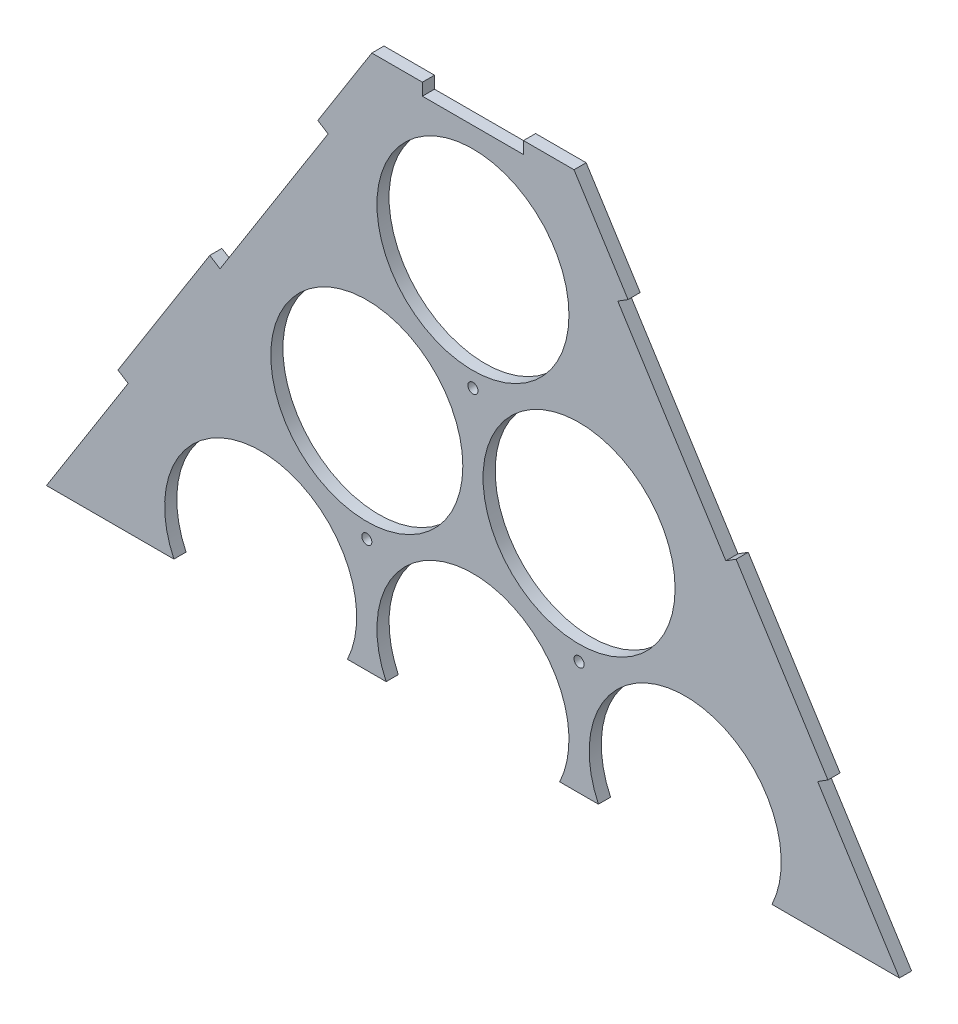
ISO-10303-21;
HEADER;
FILE_DESCRIPTION(('STEP AP214'),'2;1');
FILE_NAME('part.step','',(''),(''),'','','');
FILE_SCHEMA(('AUTOMOTIVE_DESIGN { 1 0 10303 214 1 1 1 1 }'));
ENDSEC;
DATA;
#1=APPLICATION_CONTEXT('core data for automotive mechanical design processes');
#2=APPLICATION_PROTOCOL_DEFINITION('international standard','automotive_design',2000,#1);
#3=PRODUCT_CONTEXT('',#1,'mechanical');
#4=PRODUCT('Part','Part','',(#3));
#5=PRODUCT_RELATED_PRODUCT_CATEGORY('part','',(#4));
#6=PRODUCT_DEFINITION_FORMATION('','',#4);
#7=PRODUCT_DEFINITION_CONTEXT('part definition',#1,'design');
#8=PRODUCT_DEFINITION('design','',#6,#7);
#9=PRODUCT_DEFINITION_SHAPE('','',#8);
#10=(LENGTH_UNIT() NAMED_UNIT(*) SI_UNIT(.MILLI.,.METRE.));
#11=(NAMED_UNIT(*) PLANE_ANGLE_UNIT() SI_UNIT($,.RADIAN.));
#12=(NAMED_UNIT(*) SI_UNIT($,.STERADIAN.) SOLID_ANGLE_UNIT());
#13=UNCERTAINTY_MEASURE_WITH_UNIT(LENGTH_MEASURE(1.E-05),#10,'distance_accuracy_value','');
#14=(GEOMETRIC_REPRESENTATION_CONTEXT(3) GLOBAL_UNCERTAINTY_ASSIGNED_CONTEXT((#13)) GLOBAL_UNIT_ASSIGNED_CONTEXT((#10,
#11,#12)) REPRESENTATION_CONTEXT('',''));
#15=CARTESIAN_POINT('',(0.,0.,0.));
#16=DIRECTION('',(0.,0.,1.));
#17=DIRECTION('',(1.,0.,0.));
#18=AXIS2_PLACEMENT_3D('',#15,#16,#17);
#19=CARTESIAN_POINT('',(-50.0000000000002,336.353741833179,6.));
#20=DIRECTION('',(0.845179377846631,-0.53448275862069,0.));
#21=DIRECTION('',(0.53448275862069,0.845179377846631,0.));
#22=AXIS2_PLACEMENT_3D('',#19,#20,#21);
#23=PLANE('',#22);
#24=DIRECTION('',(-0.53448275862069,-0.845179377846631,0.));
#25=VECTOR('',#24,1.);
#26=CARTESIAN_POINT('',(-50.0000000000002,336.353741833179,0.));
#27=LINE('',#26,#25);
#28=CARTESIAN_POINT('',(-50.0000000000002,336.353741833179,0.));
#29=VERTEX_POINT('',#28);
#30=CARTESIAN_POINT('',(-76.7241379310347,294.094772940848,0.));
#31=VERTEX_POINT('',#30);
#32=EDGE_CURVE('E320',#29,#31,#27,.T.);
#33=ORIENTED_EDGE('',*,*,#32,.T.);
#34=DIRECTION('',(0.,0.,1.));
#35=VECTOR('',#34,1.);
#36=CARTESIAN_POINT('',(-76.7241379310347,294.094772940848,6.));
#37=LINE('',#36,#35);
#38=CARTESIAN_POINT('',(-76.7241379310347,294.094772940848,6.));
#39=VERTEX_POINT('',#38);
#40=EDGE_CURVE('E356',#31,#39,#37,.T.);
#41=ORIENTED_EDGE('',*,*,#40,.T.);
#42=DIRECTION('',(-0.53448275862069,-0.845179377846631,0.));
#43=VECTOR('',#42,1.);
#44=CARTESIAN_POINT('',(-50.0000000000002,336.353741833179,6.));
#45=LINE('',#44,#43);
#46=CARTESIAN_POINT('',(-50.0000000000002,336.353741833179,6.));
#47=VERTEX_POINT('',#46);
#48=EDGE_CURVE('E308',#47,#39,#45,.T.);
#49=ORIENTED_EDGE('',*,*,#48,.F.);
#50=DIRECTION('',(0.,0.,-1.));
#51=VECTOR('',#50,1.);
#52=CARTESIAN_POINT('',(-50.0000000000002,336.353741833179,6.));
#53=LINE('',#52,#51);
#54=EDGE_CURVE('E318',#47,#29,#53,.T.);
#55=ORIENTED_EDGE('',*,*,#54,.T.);
#56=EDGE_LOOP('',(#33,#41,#49,#55));
#57=FACE_BOUND('',#56,.T.);
#58=ADVANCED_FACE('F34',(#57),#23,.F.);
#59=CARTESIAN_POINT('',(-130.172413793106,209.576835156186,6.));
#60=VERTEX_POINT('',#59);
#61=CARTESIAN_POINT('',(-175.603448275862,137.736588039221,6.));
#62=VERTEX_POINT('',#61);
#63=EDGE_CURVE('E312',#60,#62,#45,.T.);
#64=ORIENTED_EDGE('',*,*,#63,.F.);
#65=DIRECTION('',(0.,0.,-1.));
#66=VECTOR('',#65,1.);
#67=CARTESIAN_POINT('',(-130.172413793104,209.576835156185,6.));
#68=LINE('',#67,#66);
#69=CARTESIAN_POINT('',(-130.172413793104,209.576835156185,0.));
#70=VERTEX_POINT('',#69);
#71=EDGE_CURVE('E353',#60,#70,#68,.T.);
#72=ORIENTED_EDGE('',*,*,#71,.T.);
#73=CARTESIAN_POINT('',(-175.603448275862,137.736588039221,0.));
#74=VERTEX_POINT('',#73);
#75=EDGE_CURVE('E305',#70,#74,#27,.T.);
#76=ORIENTED_EDGE('',*,*,#75,.T.);
#77=DIRECTION('',(0.,0.,1.));
#78=VECTOR('',#77,1.);
#79=CARTESIAN_POINT('',(-175.603448275862,137.736588039221,6.));
#80=LINE('',#79,#78);
#81=EDGE_CURVE('E350',#74,#62,#80,.T.);
#82=ORIENTED_EDGE('',*,*,#81,.T.);
#83=EDGE_LOOP('',(#64,#72,#76,#82));
#84=FACE_BOUND('',#83,.T.);
#85=ADVANCED_FACE('F473',(#84),#23,.F.);
#86=CARTESIAN_POINT('',(255.775862068966,10.9596813622265,6.));
#87=DIRECTION('',(-0.84517937784663,-0.53448275862069,0.));
#88=DIRECTION('',(0.53448275862069,-0.84517937784663,0.));
#89=AXIS2_PLACEMENT_3D('',#86,#87,#88);
#90=PLANE('',#89);
#91=DIRECTION('',(-0.53448275862069,0.84517937784663,0.));
#92=VECTOR('',#91,1.);
#93=CARTESIAN_POINT('',(255.775862068966,10.9596813622265,6.));
#94=LINE('',#93,#92);
#95=CARTESIAN_POINT('',(175.603448275862,137.736588039221,6.));
#96=VERTEX_POINT('',#95);
#97=CARTESIAN_POINT('',(130.172413793102,209.576835156186,6.));
#98=VERTEX_POINT('',#97);
#99=EDGE_CURVE('E314',#96,#98,#94,.T.);
#100=ORIENTED_EDGE('',*,*,#99,.F.);
#101=DIRECTION('',(0.,0.,-1.));
#102=VECTOR('',#101,1.);
#103=CARTESIAN_POINT('',(175.603448275862,137.736588039221,6.));
#104=LINE('',#103,#102);
#105=CARTESIAN_POINT('',(175.603448275862,137.736588039221,0.));
#106=VERTEX_POINT('',#105);
#107=EDGE_CURVE('E347',#96,#106,#104,.T.);
#108=ORIENTED_EDGE('',*,*,#107,.T.);
#109=DIRECTION('',(-0.53448275862069,0.84517937784663,0.));
#110=VECTOR('',#109,1.);
#111=CARTESIAN_POINT('',(255.775862068966,10.9596813622265,0.));
#112=LINE('',#111,#110);
#113=CARTESIAN_POINT('',(130.172413793102,209.576835156184,0.));
#114=VERTEX_POINT('',#113);
#115=EDGE_CURVE('E325',#106,#114,#112,.T.);
#116=ORIENTED_EDGE('',*,*,#115,.T.);
#117=DIRECTION('',(0.,0.,1.));
#118=VECTOR('',#117,1.);
#119=CARTESIAN_POINT('',(130.172413793103,209.576835156185,6.));
#120=LINE('',#119,#118);
#121=EDGE_CURVE('E341',#114,#98,#120,.T.);
#122=ORIENTED_EDGE('',*,*,#121,.T.);
#123=EDGE_LOOP('',(#100,#108,#116,#122));
#124=FACE_BOUND('',#123,.T.);
#125=ADVANCED_FACE('F503',(#124),#90,.F.);
#126=CARTESIAN_POINT('',(76.7241379310346,294.094772940848,6.));
#127=VERTEX_POINT('',#126);
#128=CARTESIAN_POINT('',(49.9999999999998,336.353741833179,6.));
#129=VERTEX_POINT('',#128);
#130=EDGE_CURVE('E311',#127,#129,#94,.T.);
#131=ORIENTED_EDGE('',*,*,#130,.F.);
#132=DIRECTION('',(0.,0.,-1.));
#133=VECTOR('',#132,1.);
#134=CARTESIAN_POINT('',(76.7241379310345,294.094772940847,6.));
#135=LINE('',#134,#133);
#136=CARTESIAN_POINT('',(76.7241379310346,294.094772940848,0.));
#137=VERTEX_POINT('',#136);
#138=EDGE_CURVE('E344',#127,#137,#135,.T.);
#139=ORIENTED_EDGE('',*,*,#138,.T.);
#140=CARTESIAN_POINT('',(49.9999999999998,336.353741833179,0.));
#141=VERTEX_POINT('',#140);
#142=EDGE_CURVE('E323',#137,#141,#112,.T.);
#143=ORIENTED_EDGE('',*,*,#142,.T.);
#144=DIRECTION('',(0.,0.,-1.));
#145=VECTOR('',#144,1.);
#146=CARTESIAN_POINT('',(49.9999999999998,336.353741833179,6.));
#147=LINE('',#146,#145);
#148=EDGE_CURVE('E332',#129,#141,#147,.T.);
#149=ORIENTED_EDGE('',*,*,#148,.F.);
#150=EDGE_LOOP('',(#131,#139,#143,#149));
#151=FACE_BOUND('',#150,.T.);
#152=ADVANCED_FACE('F511',(#151),#90,.F.);
#153=CARTESIAN_POINT('',(-50.0000000000002,336.353741833179,6.));
#154=DIRECTION('',(0.,-1.,0.));
#155=DIRECTION('',(1.,0.,0.));
#156=AXIS2_PLACEMENT_3D('',#153,#154,#155);
#157=PLANE('',#156);
#158=DIRECTION('',(-1.,0.,0.));
#159=VECTOR('',#158,1.);
#160=CARTESIAN_POINT('',(-50.0000000000002,336.353741833179,6.));
#161=LINE('',#160,#159);
#162=CARTESIAN_POINT('',(-25.,336.353741833179,6.));
#163=VERTEX_POINT('',#162);
#164=EDGE_CURVE('E319',#163,#47,#161,.T.);
#165=ORIENTED_EDGE('',*,*,#164,.F.);
#166=DIRECTION('',(0.,0.,-1.));
#167=VECTOR('',#166,1.);
#168=CARTESIAN_POINT('',(-25.,336.353741833179,6.));
#169=LINE('',#168,#167);
#170=CARTESIAN_POINT('',(-25.,336.353741833179,0.));
#171=VERTEX_POINT('',#170);
#172=EDGE_CURVE('E338',#163,#171,#169,.T.);
#173=ORIENTED_EDGE('',*,*,#172,.T.);
#174=DIRECTION('',(-1.,0.,0.));
#175=VECTOR('',#174,1.);
#176=CARTESIAN_POINT('',(-50.0000000000002,336.353741833179,0.));
#177=LINE('',#176,#175);
#178=EDGE_CURVE('E329',#171,#29,#177,.T.);
#179=ORIENTED_EDGE('',*,*,#178,.T.);
#180=ORIENTED_EDGE('',*,*,#54,.F.);
#181=EDGE_LOOP('',(#165,#173,#179,#180));
#182=FACE_BOUND('',#181,.T.);
#183=ADVANCED_FACE('F447',(#182),#157,.F.);
#184=CARTESIAN_POINT('',(0.,0.,6.));
#185=DIRECTION('',(0.,0.,-1.));
#186=DIRECTION('',(-1.,0.,0.));
#187=AXIS2_PLACEMENT_3D('',#184,#185,#186);
#188=PLANE('',#187);
#189=CARTESIAN_POINT('',(-52.5,126.865334794732,6.));
#190=DIRECTION('',(0.,0.,1.));
#191=DIRECTION('',(1.,0.,0.));
#192=AXIS2_PLACEMENT_3D('',#189,#190,#191);
#193=CIRCLE('',#192,2.5);
#194=CARTESIAN_POINT('',(-50.,126.865334794732,6.));
#195=VERTEX_POINT('',#194);
#196=EDGE_CURVE('E372',#195,#195,#193,.T.);
#197=ORIENTED_EDGE('',*,*,#196,.F.);
#198=EDGE_LOOP('',(#197));
#199=FACE_BOUND('',#198,.T.);
#200=CARTESIAN_POINT('',(0.,217.798002192098,6.));
#201=DIRECTION('',(0.,0.,1.));
#202=DIRECTION('',(1.,0.,0.));
#203=AXIS2_PLACEMENT_3D('',#200,#201,#202);
#204=CIRCLE('',#203,2.5);
#205=CARTESIAN_POINT('',(2.5,217.798002192098,6.));
#206=VERTEX_POINT('',#205);
#207=EDGE_CURVE('E812',#206,#206,#204,.T.);
#208=ORIENTED_EDGE('',*,*,#207,.F.);
#209=EDGE_LOOP('',(#208));
#210=FACE_BOUND('',#209,.T.);
#211=CARTESIAN_POINT('',(52.5,126.865334794732,6.));
#212=DIRECTION('',(0.,0.,1.));
#213=DIRECTION('',(1.,0.,0.));
#214=AXIS2_PLACEMENT_3D('',#211,#212,#213);
#215=CIRCLE('',#214,2.5);
#216=CARTESIAN_POINT('',(55.,126.865334794732,6.));
#217=VERTEX_POINT('',#216);
#218=EDGE_CURVE('E384',#217,#217,#215,.T.);
#219=ORIENTED_EDGE('',*,*,#218,.F.);
#220=EDGE_LOOP('',(#219));
#221=FACE_BOUND('',#220,.T.);
#222=DIRECTION('',(0.53448275862069,0.84517937784663,0.));
#223=VECTOR('',#222,1.);
#224=CARTESIAN_POINT('',(-223.980647870851,50.0117537028338,6.));
#225=LINE('',#224,#223);
#226=CARTESIAN_POINT('',(-210.972398171467,70.5817425574265,6.));
#227=VERTEX_POINT('',#226);
#228=CARTESIAN_POINT('',(-170.532372008782,134.529691487497,6.));
#229=VERTEX_POINT('',#228);
#230=EDGE_CURVE('E249',#227,#229,#225,.T.);
#231=ORIENTED_EDGE('',*,*,#230,.F.);
#232=DIRECTION('',(-1.,0.,0.));
#233=VECTOR('',#232,1.);
#234=CARTESIAN_POINT('',(314.768700541544,70.5817425574265,6.));
#235=LINE('',#234,#233);
#236=CARTESIAN_POINT('',(-147.919574300768,70.5817425574265,6.));
#237=VERTEX_POINT('',#236);
#238=EDGE_CURVE('E233',#237,#227,#235,.T.);
#239=ORIENTED_EDGE('',*,*,#238,.F.);
#240=CARTESIAN_POINT('',(-105.,90.932667397366,6.));
#241=DIRECTION('',(0.,0.,1.));
#242=DIRECTION('',(1.,0.,0.));
#243=AXIS2_PLACEMENT_3D('',#240,#241,#242);
#244=CIRCLE('',#243,47.5);
#245=CARTESIAN_POINT('',(-62.0804256992321,70.5817425574265,6.));
#246=VERTEX_POINT('',#245);
#247=EDGE_CURVE('E302',#246,#237,#244,.T.);
#248=ORIENTED_EDGE('',*,*,#247,.F.);
#249=CARTESIAN_POINT('',(-42.9195743007679,70.5817425574265,6.));
#250=VERTEX_POINT('',#249);
#251=EDGE_CURVE('E379',#250,#246,#235,.T.);
#252=ORIENTED_EDGE('',*,*,#251,.F.);
#253=CARTESIAN_POINT('',(0.,90.932667397366,6.));
#254=DIRECTION('',(0.,0.,1.));
#255=DIRECTION('',(1.,0.,0.));
#256=AXIS2_PLACEMENT_3D('',#253,#254,#255);
#257=CIRCLE('',#256,47.5);
#258=CARTESIAN_POINT('',(42.9195743007679,70.5817425574265,6.));
#259=VERTEX_POINT('',#258);
#260=EDGE_CURVE('E296',#259,#250,#257,.T.);
#261=ORIENTED_EDGE('',*,*,#260,.F.);
#262=CARTESIAN_POINT('',(62.0804256992321,70.5817425574265,6.));
#263=VERTEX_POINT('',#262);
#264=EDGE_CURVE('E231',#263,#259,#235,.T.);
#265=ORIENTED_EDGE('',*,*,#264,.F.);
#266=CARTESIAN_POINT('',(105.,90.932667397366,6.));
#267=DIRECTION('',(0.,0.,1.));
#268=DIRECTION('',(1.,0.,0.));
#269=AXIS2_PLACEMENT_3D('',#266,#267,#268);
#270=CIRCLE('',#269,47.5);
#271=CARTESIAN_POINT('',(147.919574300768,70.5817425574265,6.));
#272=VERTEX_POINT('',#271);
#273=EDGE_CURVE('E229',#272,#263,#270,.T.);
#274=ORIENTED_EDGE('',*,*,#273,.F.);
#275=CARTESIAN_POINT('',(210.972398171467,70.5817425574265,6.));
#276=VERTEX_POINT('',#275);
#277=EDGE_CURVE('E210',#276,#272,#235,.T.);
#278=ORIENTED_EDGE('',*,*,#277,.F.);
#279=DIRECTION('',(0.53448275862069,-0.84517937784663,0.));
#280=VECTOR('',#279,1.);
#281=CARTESIAN_POINT('',(223.980647870851,50.0117537028338,6.));
#282=LINE('',#281,#280);
#283=CARTESIAN_POINT('',(170.532372008782,134.529691487497,6.));
#284=VERTEX_POINT('',#283);
#285=EDGE_CURVE('E226',#284,#276,#282,.T.);
#286=ORIENTED_EDGE('',*,*,#285,.F.);
#287=DIRECTION('',(-0.845179377846625,-0.534482758620698,0.));
#288=VECTOR('',#287,1.);
#289=CARTESIAN_POINT('',(170.532372008782,134.529691487497,6.));
#290=LINE('',#289,#288);
#291=EDGE_CURVE('E238',#96,#284,#290,.T.);
#292=ORIENTED_EDGE('',*,*,#291,.F.);
#293=ORIENTED_EDGE('',*,*,#99,.T.);
#294=DIRECTION('',(0.845179377846625,0.534482758620699,0.));
#295=VECTOR('',#294,1.);
#296=CARTESIAN_POINT('',(130.172413793102,209.576835156184,6.));
#297=LINE('',#296,#295);
#298=CARTESIAN_POINT('',(125.101337526023,206.36993860446,6.));
#299=VERTEX_POINT('',#298);
#300=EDGE_CURVE('E422',#299,#98,#297,.T.);
#301=ORIENTED_EDGE('',*,*,#300,.F.);
#302=DIRECTION('',(0.53448275862069,-0.84517937784663,0.));
#303=VECTOR('',#302,1.);
#304=CARTESIAN_POINT('',(125.101337526023,206.36993860446,6.));
#305=LINE('',#304,#303);
#306=CARTESIAN_POINT('',(71.6530616639535,290.887876389123,6.));
#307=VERTEX_POINT('',#306);
#308=EDGE_CURVE('E248',#307,#299,#305,.T.);
#309=ORIENTED_EDGE('',*,*,#308,.F.);
#310=DIRECTION('',(-0.845179377846638,-0.534482758620678,0.));
#311=VECTOR('',#310,1.);
#312=CARTESIAN_POINT('',(71.6530616639535,290.887876389123,6.));
#313=LINE('',#312,#311);
#314=EDGE_CURVE('E424',#127,#307,#313,.T.);
#315=ORIENTED_EDGE('',*,*,#314,.F.);
#316=ORIENTED_EDGE('',*,*,#130,.T.);
#317=CARTESIAN_POINT('',(25.,336.353741833179,6.));
#318=VERTEX_POINT('',#317);
#319=EDGE_CURVE('E315',#129,#318,#161,.T.);
#320=ORIENTED_EDGE('',*,*,#319,.T.);
#321=DIRECTION('',(0.,1.,0.));
#322=VECTOR('',#321,1.);
#323=CARTESIAN_POINT('',(25.,336.353741833179,6.));
#324=LINE('',#323,#322);
#325=CARTESIAN_POINT('',(25.,330.353741833179,6.));
#326=VERTEX_POINT('',#325);
#327=EDGE_CURVE('E415',#326,#318,#324,.T.);
#328=ORIENTED_EDGE('',*,*,#327,.F.);
#329=DIRECTION('',(1.,0.,0.));
#330=VECTOR('',#329,1.);
#331=CARTESIAN_POINT('',(-25.,330.353741833179,6.));
#332=LINE('',#331,#330);
#333=CARTESIAN_POINT('',(-25.,330.353741833179,6.));
#334=VERTEX_POINT('',#333);
#335=EDGE_CURVE('E411',#334,#326,#332,.T.);
#336=ORIENTED_EDGE('',*,*,#335,.F.);
#337=DIRECTION('',(0.,-1.,0.));
#338=VECTOR('',#337,1.);
#339=CARTESIAN_POINT('',(-25.,336.353741833179,6.));
#340=LINE('',#339,#338);
#341=EDGE_CURVE('E408',#163,#334,#340,.T.);
#342=ORIENTED_EDGE('',*,*,#341,.F.);
#343=ORIENTED_EDGE('',*,*,#164,.T.);
#344=ORIENTED_EDGE('',*,*,#48,.T.);
#345=DIRECTION('',(-0.845179377846631,0.534482758620689,0.));
#346=VECTOR('',#345,1.);
#347=CARTESIAN_POINT('',(-71.6530616639567,290.887876389125,6.));
#348=LINE('',#347,#346);
#349=CARTESIAN_POINT('',(-71.6530616639567,290.887876389125,6.));
#350=VERTEX_POINT('',#349);
#351=EDGE_CURVE('E403',#350,#39,#348,.T.);
#352=ORIENTED_EDGE('',*,*,#351,.F.);
#353=DIRECTION('',(0.53448275862069,0.84517937784663,0.));
#354=VECTOR('',#353,1.);
#355=CARTESIAN_POINT('',(-125.101337526026,206.369938604462,6.));
#356=LINE('',#355,#354);
#357=CARTESIAN_POINT('',(-125.101337526026,206.369938604462,6.));
#358=VERTEX_POINT('',#357);
#359=EDGE_CURVE('E399',#358,#350,#356,.T.);
#360=ORIENTED_EDGE('',*,*,#359,.F.);
#361=DIRECTION('',(0.845179377846637,-0.53448275862068,0.));
#362=VECTOR('',#361,1.);
#363=CARTESIAN_POINT('',(-130.172413793106,209.576835156186,6.));
#364=LINE('',#363,#362);
#365=EDGE_CURVE('E396',#60,#358,#364,.T.);
#366=ORIENTED_EDGE('',*,*,#365,.F.);
#367=ORIENTED_EDGE('',*,*,#63,.T.);
#368=DIRECTION('',(-0.845179377846629,0.534482758620692,0.));
#369=VECTOR('',#368,1.);
#370=CARTESIAN_POINT('',(-170.532372008782,134.529691487497,6.));
#371=LINE('',#370,#369);
#372=EDGE_CURVE('E251',#229,#62,#371,.T.);
#373=ORIENTED_EDGE('',*,*,#372,.F.);
#374=EDGE_LOOP('',(#231,#239,#248,#252,#261,#265,#274,#278,#286,#292,#293,#301,#309,#315,#316,
#320,#328,#336,#342,#343,#344,#352,#360,#366,#367,#373));
#375=FACE_BOUND('',#374,.T.);
#376=CARTESIAN_POINT('',(-52.5,181.865334794732,6.));
#377=DIRECTION('',(0.,0.,1.));
#378=DIRECTION('',(1.,0.,0.));
#379=AXIS2_PLACEMENT_3D('',#376,#377,#378);
#380=CIRCLE('',#379,47.5);
#381=CARTESIAN_POINT('',(-4.99999999999998,181.865334794732,6.));
#382=VERTEX_POINT('',#381);
#383=EDGE_CURVE('E286',#382,#382,#380,.T.);
#384=ORIENTED_EDGE('',*,*,#383,.F.);
#385=EDGE_LOOP('',(#384));
#386=FACE_BOUND('',#385,.T.);
#387=CARTESIAN_POINT('',(52.5,181.865334794732,6.));
#388=DIRECTION('',(0.,0.,1.));
#389=DIRECTION('',(1.,0.,0.));
#390=AXIS2_PLACEMENT_3D('',#387,#388,#389);
#391=CIRCLE('',#390,47.5);
#392=CARTESIAN_POINT('',(100.,181.865334794732,6.));
#393=VERTEX_POINT('',#392);
#394=EDGE_CURVE('E280',#393,#393,#391,.T.);
#395=ORIENTED_EDGE('',*,*,#394,.F.);
#396=EDGE_LOOP('',(#395));
#397=FACE_BOUND('',#396,.T.);
#398=CARTESIAN_POINT('',(0.,272.798002192098,6.));
#399=DIRECTION('',(0.,0.,1.));
#400=DIRECTION('',(1.,0.,0.));
#401=AXIS2_PLACEMENT_3D('',#398,#399,#400);
#402=CIRCLE('',#401,47.5);
#403=CARTESIAN_POINT('',(47.5,272.798002192098,6.));
#404=VERTEX_POINT('',#403);
#405=EDGE_CURVE('E274',#404,#404,#402,.T.);
#406=ORIENTED_EDGE('',*,*,#405,.F.);
#407=EDGE_LOOP('',(#406));
#408=FACE_BOUND('',#407,.T.);
#409=ADVANCED_FACE('F223',(#199,#210,#221,#375,#386,#397,#408),#188,.F.);
#410=CARTESIAN_POINT('',(0.,0.,0.));
#411=DIRECTION('',(0.,0.,-1.));
#412=DIRECTION('',(-1.,0.,0.));
#413=AXIS2_PLACEMENT_3D('',#410,#411,#412);
#414=PLANE('',#413);
#415=CARTESIAN_POINT('',(-52.5,126.865334794732,0.));
#416=DIRECTION('',(0.,0.,-1.));
#417=DIRECTION('',(-1.,0.,0.));
#418=AXIS2_PLACEMENT_3D('',#415,#416,#417);
#419=CIRCLE('',#418,2.5);
#420=CARTESIAN_POINT('',(-55.,126.865334794732,0.));
#421=VERTEX_POINT('',#420);
#422=EDGE_CURVE('E37',#421,#421,#419,.T.);
#423=ORIENTED_EDGE('',*,*,#422,.F.);
#424=EDGE_LOOP('',(#423));
#425=FACE_BOUND('',#424,.T.);
#426=CARTESIAN_POINT('',(0.,217.798002192098,0.));
#427=DIRECTION('',(0.,0.,-1.));
#428=DIRECTION('',(-1.,0.,0.));
#429=AXIS2_PLACEMENT_3D('',#426,#427,#428);
#430=CIRCLE('',#429,2.5);
#431=CARTESIAN_POINT('',(-2.5,217.798002192098,0.));
#432=VERTEX_POINT('',#431);
#433=EDGE_CURVE('E371',#432,#432,#430,.T.);
#434=ORIENTED_EDGE('',*,*,#433,.F.);
#435=EDGE_LOOP('',(#434));
#436=FACE_BOUND('',#435,.T.);
#437=CARTESIAN_POINT('',(52.5,126.865334794732,0.));
#438=DIRECTION('',(0.,0.,-1.));
#439=DIRECTION('',(-1.,0.,0.));
#440=AXIS2_PLACEMENT_3D('',#437,#438,#439);
#441=CIRCLE('',#440,2.5);
#442=CARTESIAN_POINT('',(50.,126.865334794732,0.));
#443=VERTEX_POINT('',#442);
#444=EDGE_CURVE('E369',#443,#443,#441,.T.);
#445=ORIENTED_EDGE('',*,*,#444,.F.);
#446=EDGE_LOOP('',(#445));
#447=FACE_BOUND('',#446,.T.);
#448=DIRECTION('',(1.,0.,0.));
#449=VECTOR('',#448,1.);
#450=CARTESIAN_POINT('',(0.,70.5817425574265,0.));
#451=LINE('',#450,#449);
#452=CARTESIAN_POINT('',(-210.972398171467,70.5817425574265,0.));
#453=VERTEX_POINT('',#452);
#454=CARTESIAN_POINT('',(-147.919574300768,70.5817425574265,0.));
#455=VERTEX_POINT('',#454);
#456=EDGE_CURVE('E230',#453,#455,#451,.T.);
#457=ORIENTED_EDGE('',*,*,#456,.F.);
#458=DIRECTION('',(-0.53448275862069,-0.845179377846631,0.));
#459=VECTOR('',#458,1.);
#460=CARTESIAN_POINT('',(-182.587688528877,115.466579063644,0.));
#461=LINE('',#460,#459);
#462=CARTESIAN_POINT('',(-170.532372008782,134.529691487497,0.));
#463=VERTEX_POINT('',#462);
#464=EDGE_CURVE('E359',#463,#453,#461,.T.);
#465=ORIENTED_EDGE('',*,*,#464,.F.);
#466=DIRECTION('',(0.84517937784663,-0.534482758620692,0.));
#467=VECTOR('',#466,1.);
#468=CARTESIAN_POINT('',(12.0553165200939,19.0631124238527,0.));
#469=LINE('',#468,#467);
#470=EDGE_CURVE('E267',#74,#463,#469,.T.);
#471=ORIENTED_EDGE('',*,*,#470,.F.);
#472=ORIENTED_EDGE('',*,*,#75,.F.);
#473=DIRECTION('',(-0.845179377846637,0.53448275862068,0.));
#474=VECTOR('',#473,1.);
#475=CARTESIAN_POINT('',(57.486351002853,90.9033595408196,0.));
#476=LINE('',#475,#474);
#477=CARTESIAN_POINT('',(-125.101337526026,206.369938604462,0.));
#478=VERTEX_POINT('',#477);
#479=EDGE_CURVE('E269',#478,#70,#476,.T.);
#480=ORIENTED_EDGE('',*,*,#479,.F.);
#481=DIRECTION('',(-0.53448275862069,-0.845179377846631,0.));
#482=VECTOR('',#481,1.);
#483=CARTESIAN_POINT('',(-182.587688528878,115.466579063645,0.));
#484=LINE('',#483,#482);
#485=CARTESIAN_POINT('',(-71.6530616639567,290.887876389125,0.));
#486=VERTEX_POINT('',#485);
#487=EDGE_CURVE('E362',#486,#478,#484,.T.);
#488=ORIENTED_EDGE('',*,*,#487,.F.);
#489=DIRECTION('',(0.845179377846631,-0.534482758620688,0.));
#490=VECTOR('',#489,1.);
#491=CARTESIAN_POINT('',(110.934626864922,175.42129732548,0.));
#492=LINE('',#491,#490);
#493=EDGE_CURVE('E271',#31,#486,#492,.T.);
#494=ORIENTED_EDGE('',*,*,#493,.F.);
#495=ORIENTED_EDGE('',*,*,#32,.F.);
#496=ORIENTED_EDGE('',*,*,#178,.F.);
#497=DIRECTION('',(0.,1.,0.));
#498=VECTOR('',#497,1.);
#499=CARTESIAN_POINT('',(-25.,0.,0.));
#500=LINE('',#499,#498);
#501=CARTESIAN_POINT('',(-25.,330.353741833179,0.));
#502=VERTEX_POINT('',#501);
#503=EDGE_CURVE('E259',#502,#171,#500,.T.);
#504=ORIENTED_EDGE('',*,*,#503,.F.);
#505=DIRECTION('',(-1.,0.,0.));
#506=VECTOR('',#505,1.);
#507=CARTESIAN_POINT('',(3.6676633045427E-13,330.353741833179,0.));
#508=LINE('',#507,#506);
#509=CARTESIAN_POINT('',(25.,330.353741833179,0.));
#510=VERTEX_POINT('',#509);
#511=EDGE_CURVE('E364',#510,#502,#508,.T.);
#512=ORIENTED_EDGE('',*,*,#511,.F.);
#513=DIRECTION('',(0.,-1.,0.));
#514=VECTOR('',#513,1.);
#515=CARTESIAN_POINT('',(25.0000000000003,0.,0.));
#516=LINE('',#515,#514);
#517=CARTESIAN_POINT('',(25.,336.353741833179,0.));
#518=VERTEX_POINT('',#517);
#519=EDGE_CURVE('E257',#518,#510,#516,.T.);
#520=ORIENTED_EDGE('',*,*,#519,.F.);
#521=EDGE_CURVE('E326',#141,#518,#177,.T.);
#522=ORIENTED_EDGE('',*,*,#521,.F.);
#523=ORIENTED_EDGE('',*,*,#142,.F.);
#524=DIRECTION('',(0.845179377846638,0.534482758620678,0.));
#525=VECTOR('',#524,1.);
#526=CARTESIAN_POINT('',(-110.934626864921,175.421297325484,0.));
#527=LINE('',#526,#525);
#528=CARTESIAN_POINT('',(71.6530616639535,290.887876389123,0.));
#529=VERTEX_POINT('',#528);
#530=EDGE_CURVE('E263',#529,#137,#527,.T.);
#531=ORIENTED_EDGE('',*,*,#530,.F.);
#532=DIRECTION('',(-0.53448275862069,0.845179377846631,0.));
#533=VECTOR('',#532,1.);
#534=CARTESIAN_POINT('',(182.587688528875,115.466579063643,0.));
#535=LINE('',#534,#533);
#536=CARTESIAN_POINT('',(125.101337526023,206.36993860446,0.));
#537=VERTEX_POINT('',#536);
#538=EDGE_CURVE('E366',#537,#529,#535,.T.);
#539=ORIENTED_EDGE('',*,*,#538,.F.);
#540=DIRECTION('',(-0.845179377846625,-0.534482758620699,0.));
#541=VECTOR('',#540,1.);
#542=CARTESIAN_POINT('',(-57.4863510028525,90.9033595408141,0.));
#543=LINE('',#542,#541);
#544=EDGE_CURVE('E261',#114,#537,#543,.T.);
#545=ORIENTED_EDGE('',*,*,#544,.F.);
#546=ORIENTED_EDGE('',*,*,#115,.F.);
#547=DIRECTION('',(0.845179377846625,0.534482758620698,0.));
#548=VECTOR('',#547,1.);
#549=CARTESIAN_POINT('',(-12.0553165200932,19.0631124238512,0.));
#550=LINE('',#549,#548);
#551=CARTESIAN_POINT('',(170.532372008782,134.529691487497,0.));
#552=VERTEX_POINT('',#551);
#553=EDGE_CURVE('E265',#552,#106,#550,.T.);
#554=ORIENTED_EDGE('',*,*,#553,.F.);
#555=DIRECTION('',(-0.53448275862069,0.845179377846631,0.));
#556=VECTOR('',#555,1.);
#557=CARTESIAN_POINT('',(182.587688528876,115.466579063644,0.));
#558=LINE('',#557,#556);
#559=CARTESIAN_POINT('',(210.972398171467,70.5817425574265,0.));
#560=VERTEX_POINT('',#559);
#561=EDGE_CURVE('E42',#560,#552,#558,.T.);
#562=ORIENTED_EDGE('',*,*,#561,.F.);
#563=CARTESIAN_POINT('',(147.919574300768,70.5817425574265,0.));
#564=VERTEX_POINT('',#563);
#565=EDGE_CURVE('E213',#564,#560,#451,.T.);
#566=ORIENTED_EDGE('',*,*,#565,.F.);
#567=CARTESIAN_POINT('',(105.,90.932667397366,0.));
#568=DIRECTION('',(0.,0.,1.));
#569=DIRECTION('',(1.,0.,0.));
#570=AXIS2_PLACEMENT_3D('',#567,#568,#569);
#571=CIRCLE('',#570,47.5);
#572=CARTESIAN_POINT('',(62.0804256992321,70.5817425574265,0.));
#573=VERTEX_POINT('',#572);
#574=EDGE_CURVE('E289',#564,#573,#571,.T.);
#575=ORIENTED_EDGE('',*,*,#574,.T.);
#576=CARTESIAN_POINT('',(42.9195743007679,70.5817425574265,0.));
#577=VERTEX_POINT('',#576);
#578=EDGE_CURVE('E58',#577,#573,#451,.T.);
#579=ORIENTED_EDGE('',*,*,#578,.F.);
#580=CARTESIAN_POINT('',(0.,90.932667397366,0.));
#581=DIRECTION('',(0.,0.,1.));
#582=DIRECTION('',(1.,0.,0.));
#583=AXIS2_PLACEMENT_3D('',#580,#581,#582);
#584=CIRCLE('',#583,47.5);
#585=CARTESIAN_POINT('',(-42.9195743007679,70.5817425574265,0.));
#586=VERTEX_POINT('',#585);
#587=EDGE_CURVE('E293',#577,#586,#584,.T.);
#588=ORIENTED_EDGE('',*,*,#587,.T.);
#589=CARTESIAN_POINT('',(-62.0804256992321,70.5817425574265,0.));
#590=VERTEX_POINT('',#589);
#591=EDGE_CURVE('E50',#590,#586,#451,.T.);
#592=ORIENTED_EDGE('',*,*,#591,.F.);
#593=CARTESIAN_POINT('',(-105.,90.932667397366,0.));
#594=DIRECTION('',(0.,0.,1.));
#595=DIRECTION('',(1.,0.,0.));
#596=AXIS2_PLACEMENT_3D('',#593,#594,#595);
#597=CIRCLE('',#596,47.5);
#598=EDGE_CURVE('E299',#590,#455,#597,.T.);
#599=ORIENTED_EDGE('',*,*,#598,.T.);
#600=EDGE_LOOP('',(#457,#465,#471,#472,#480,#488,#494,#495,#496,#504,#512,#520,#522,#523,#531,
#539,#545,#546,#554,#562,#566,#575,#579,#588,#592,#599));
#601=FACE_BOUND('',#600,.T.);
#602=CARTESIAN_POINT('',(52.5,181.865334794732,0.));
#603=DIRECTION('',(0.,0.,1.));
#604=DIRECTION('',(1.,0.,0.));
#605=AXIS2_PLACEMENT_3D('',#602,#603,#604);
#606=CIRCLE('',#605,47.5);
#607=CARTESIAN_POINT('',(100.,181.865334794732,0.));
#608=VERTEX_POINT('',#607);
#609=EDGE_CURVE('E277',#608,#608,#606,.T.);
#610=ORIENTED_EDGE('',*,*,#609,.T.);
#611=EDGE_LOOP('',(#610));
#612=FACE_BOUND('',#611,.T.);
#613=CARTESIAN_POINT('',(-52.5,181.865334794732,0.));
#614=DIRECTION('',(0.,0.,1.));
#615=DIRECTION('',(1.,0.,0.));
#616=AXIS2_PLACEMENT_3D('',#613,#614,#615);
#617=CIRCLE('',#616,47.5);
#618=CARTESIAN_POINT('',(-4.99999999999998,181.865334794732,0.));
#619=VERTEX_POINT('',#618);
#620=EDGE_CURVE('E283',#619,#619,#617,.T.);
#621=ORIENTED_EDGE('',*,*,#620,.T.);
#622=EDGE_LOOP('',(#621));
#623=FACE_BOUND('',#622,.T.);
#624=CARTESIAN_POINT('',(0.,272.798002192098,0.));
#625=DIRECTION('',(0.,0.,1.));
#626=DIRECTION('',(1.,0.,0.));
#627=AXIS2_PLACEMENT_3D('',#624,#625,#626);
#628=CIRCLE('',#627,47.5);
#629=CARTESIAN_POINT('',(47.5,272.798002192098,0.));
#630=VERTEX_POINT('',#629);
#631=EDGE_CURVE('E273',#630,#630,#628,.T.);
#632=ORIENTED_EDGE('',*,*,#631,.T.);
#633=EDGE_LOOP('',(#632));
#634=FACE_BOUND('',#633,.T.);
#635=ADVANCED_FACE('F458',(#425,#436,#447,#601,#612,#623,#634),#414,.T.);
#636=ORIENTED_EDGE('',*,*,#521,.T.);
#637=DIRECTION('',(0.,0.,1.));
#638=VECTOR('',#637,1.);
#639=CARTESIAN_POINT('',(25.,336.353741833179,6.));
#640=LINE('',#639,#638);
#641=EDGE_CURVE('E335',#518,#318,#640,.T.);
#642=ORIENTED_EDGE('',*,*,#641,.T.);
#643=ORIENTED_EDGE('',*,*,#319,.F.);
#644=ORIENTED_EDGE('',*,*,#148,.T.);
#645=EDGE_LOOP('',(#636,#642,#643,#644));
#646=FACE_BOUND('',#645,.T.);
#647=ADVANCED_FACE('F515',(#646),#157,.F.);
#648=CARTESIAN_POINT('',(-105.,90.932667397366,6.));
#649=DIRECTION('',(0.,0.,-1.));
#650=DIRECTION('',(-1.,0.,0.));
#651=AXIS2_PLACEMENT_3D('',#648,#649,#650);
#652=CYLINDRICAL_SURFACE('',#651,47.5);
#653=DIRECTION('',(0.,0.,-1.));
#654=VECTOR('',#653,1.);
#655=CARTESIAN_POINT('',(-62.0804256992321,70.5817425574265,6.));
#656=LINE('',#655,#654);
#657=EDGE_CURVE('E239',#246,#590,#656,.T.);
#658=ORIENTED_EDGE('',*,*,#657,.F.);
#659=ORIENTED_EDGE('',*,*,#247,.T.);
#660=DIRECTION('',(0.,0.,-1.));
#661=VECTOR('',#660,1.);
#662=CARTESIAN_POINT('',(-147.919574300768,70.5817425574265,6.));
#663=LINE('',#662,#661);
#664=EDGE_CURVE('E217',#455,#237,#663,.F.);
#665=ORIENTED_EDGE('',*,*,#664,.F.);
#666=ORIENTED_EDGE('',*,*,#598,.F.);
#667=EDGE_LOOP('',(#658,#659,#665,#666));
#668=FACE_BOUND('',#667,.T.);
#669=ADVANCED_FACE('F487',(#668),#652,.F.);
#670=CARTESIAN_POINT('',(0.,90.932667397366,6.));
#671=DIRECTION('',(0.,0.,-1.));
#672=DIRECTION('',(-1.,0.,0.));
#673=AXIS2_PLACEMENT_3D('',#670,#671,#672);
#674=CYLINDRICAL_SURFACE('',#673,47.5);
#675=DIRECTION('',(0.,0.,-1.));
#676=VECTOR('',#675,1.);
#677=CARTESIAN_POINT('',(42.9195743007679,70.5817425574265,6.));
#678=LINE('',#677,#676);
#679=EDGE_CURVE('E392',#259,#577,#678,.T.);
#680=ORIENTED_EDGE('',*,*,#679,.F.);
#681=ORIENTED_EDGE('',*,*,#260,.T.);
#682=DIRECTION('',(0.,0.,-1.));
#683=VECTOR('',#682,1.);
#684=CARTESIAN_POINT('',(-42.9195743007679,70.5817425574265,6.));
#685=LINE('',#684,#683);
#686=EDGE_CURVE('E394',#586,#250,#685,.F.);
#687=ORIENTED_EDGE('',*,*,#686,.F.);
#688=ORIENTED_EDGE('',*,*,#587,.F.);
#689=EDGE_LOOP('',(#680,#681,#687,#688));
#690=FACE_BOUND('',#689,.T.);
#691=ADVANCED_FACE('F493',(#690),#674,.F.);
#692=CARTESIAN_POINT('',(105.,90.932667397366,6.));
#693=DIRECTION('',(0.,0.,-1.));
#694=DIRECTION('',(-1.,0.,0.));
#695=AXIS2_PLACEMENT_3D('',#692,#693,#694);
#696=CYLINDRICAL_SURFACE('',#695,47.5);
#697=DIRECTION('',(0.,0.,-1.));
#698=VECTOR('',#697,1.);
#699=CARTESIAN_POINT('',(147.919574300768,70.5817425574265,6.));
#700=LINE('',#699,#698);
#701=EDGE_CURVE('E388',#272,#564,#700,.T.);
#702=ORIENTED_EDGE('',*,*,#701,.F.);
#703=ORIENTED_EDGE('',*,*,#273,.T.);
#704=DIRECTION('',(0.,0.,-1.));
#705=VECTOR('',#704,1.);
#706=CARTESIAN_POINT('',(62.0804256992321,70.5817425574265,6.));
#707=LINE('',#706,#705);
#708=EDGE_CURVE('E390',#573,#263,#707,.F.);
#709=ORIENTED_EDGE('',*,*,#708,.F.);
#710=ORIENTED_EDGE('',*,*,#574,.F.);
#711=EDGE_LOOP('',(#702,#703,#709,#710));
#712=FACE_BOUND('',#711,.T.);
#713=ADVANCED_FACE('F496',(#712),#696,.F.);
#714=CARTESIAN_POINT('',(-52.5,181.865334794732,6.));
#715=DIRECTION('',(0.,0.,-1.));
#716=DIRECTION('',(-1.,0.,0.));
#717=AXIS2_PLACEMENT_3D('',#714,#715,#716);
#718=CYLINDRICAL_SURFACE('',#717,47.5);
#719=ORIENTED_EDGE('',*,*,#383,.T.);
#720=EDGE_LOOP('',(#719));
#721=FACE_BOUND('',#720,.T.);
#722=ORIENTED_EDGE('',*,*,#620,.F.);
#723=EDGE_LOOP('',(#722));
#724=FACE_BOUND('',#723,.T.);
#725=ADVANCED_FACE('F566',(#721,#724),#718,.F.);
#726=CARTESIAN_POINT('',(52.5,181.865334794732,6.));
#727=DIRECTION('',(0.,0.,-1.));
#728=DIRECTION('',(-1.,0.,0.));
#729=AXIS2_PLACEMENT_3D('',#726,#727,#728);
#730=CYLINDRICAL_SURFACE('',#729,47.5);
#731=ORIENTED_EDGE('',*,*,#394,.T.);
#732=EDGE_LOOP('',(#731));
#733=FACE_BOUND('',#732,.T.);
#734=ORIENTED_EDGE('',*,*,#609,.F.);
#735=EDGE_LOOP('',(#734));
#736=FACE_BOUND('',#735,.T.);
#737=ADVANCED_FACE('F536',(#733,#736),#730,.F.);
#738=CARTESIAN_POINT('',(0.,272.798002192098,6.));
#739=DIRECTION('',(0.,0.,-1.));
#740=DIRECTION('',(-1.,0.,0.));
#741=AXIS2_PLACEMENT_3D('',#738,#739,#740);
#742=CYLINDRICAL_SURFACE('',#741,47.5);
#743=ORIENTED_EDGE('',*,*,#405,.T.);
#744=EDGE_LOOP('',(#743));
#745=FACE_BOUND('',#744,.T.);
#746=ORIENTED_EDGE('',*,*,#631,.F.);
#747=EDGE_LOOP('',(#746));
#748=FACE_BOUND('',#747,.T.);
#749=ADVANCED_FACE('F529',(#745,#748),#742,.F.);
#750=CARTESIAN_POINT('',(-25.,336.353741833179,-4.));
#751=DIRECTION('',(-1.,0.,0.));
#752=DIRECTION('',(0.,0.,1.));
#753=AXIS2_PLACEMENT_3D('',#750,#751,#752);
#754=PLANE('',#753);
#755=ORIENTED_EDGE('',*,*,#503,.T.);
#756=ORIENTED_EDGE('',*,*,#172,.F.);
#757=ORIENTED_EDGE('',*,*,#341,.T.);
#758=DIRECTION('',(0.,0.,1.));
#759=VECTOR('',#758,1.);
#760=CARTESIAN_POINT('',(-25.,330.353741833179,-4.));
#761=LINE('',#760,#759);
#762=EDGE_CURVE('E417',#502,#334,#761,.T.);
#763=ORIENTED_EDGE('',*,*,#762,.F.);
#764=EDGE_LOOP('',(#755,#756,#757,#763));
#765=FACE_BOUND('',#764,.T.);
#766=ADVANCED_FACE('F527',(#765),#754,.F.);
#767=CARTESIAN_POINT('',(25.,336.353741833179,-4.));
#768=DIRECTION('',(1.,0.,0.));
#769=DIRECTION('',(0.,1.,0.));
#770=AXIS2_PLACEMENT_3D('',#767,#768,#769);
#771=PLANE('',#770);
#772=ORIENTED_EDGE('',*,*,#519,.T.);
#773=DIRECTION('',(0.,0.,1.));
#774=VECTOR('',#773,1.);
#775=CARTESIAN_POINT('',(25.,330.353741833179,-4.));
#776=LINE('',#775,#774);
#777=EDGE_CURVE('E400',#510,#326,#776,.T.);
#778=ORIENTED_EDGE('',*,*,#777,.T.);
#779=ORIENTED_EDGE('',*,*,#327,.T.);
#780=ORIENTED_EDGE('',*,*,#641,.F.);
#781=EDGE_LOOP('',(#772,#778,#779,#780));
#782=FACE_BOUND('',#781,.T.);
#783=ADVANCED_FACE('F518',(#782),#771,.F.);
#784=CARTESIAN_POINT('',(-25.,330.353741833179,-4.));
#785=DIRECTION('',(0.,-1.,0.));
#786=DIRECTION('',(1.,0.,0.));
#787=AXIS2_PLACEMENT_3D('',#784,#785,#786);
#788=PLANE('',#787);
#789=ORIENTED_EDGE('',*,*,#511,.T.);
#790=ORIENTED_EDGE('',*,*,#762,.T.);
#791=ORIENTED_EDGE('',*,*,#335,.T.);
#792=ORIENTED_EDGE('',*,*,#777,.F.);
#793=EDGE_LOOP('',(#789,#790,#791,#792));
#794=FACE_BOUND('',#793,.T.);
#795=ADVANCED_FACE('F523',(#794),#788,.F.);
#796=CARTESIAN_POINT('',(125.101337526023,206.36993860446,-4.));
#797=DIRECTION('',(-0.84517937784663,-0.53448275862069,0.));
#798=DIRECTION('',(0.53448275862069,-0.84517937784663,0.));
#799=AXIS2_PLACEMENT_3D('',#796,#797,#798);
#800=PLANE('',#799);
#801=ORIENTED_EDGE('',*,*,#538,.T.);
#802=DIRECTION('',(0.,0.,1.));
#803=VECTOR('',#802,1.);
#804=CARTESIAN_POINT('',(71.6530616639535,290.887876389123,-4.));
#805=LINE('',#804,#803);
#806=EDGE_CURVE('E412',#529,#307,#805,.T.);
#807=ORIENTED_EDGE('',*,*,#806,.T.);
#808=ORIENTED_EDGE('',*,*,#308,.T.);
#809=DIRECTION('',(0.,0.,1.));
#810=VECTOR('',#809,1.);
#811=CARTESIAN_POINT('',(125.101337526023,206.36993860446,-4.));
#812=LINE('',#811,#810);
#813=EDGE_CURVE('E244',#537,#299,#812,.T.);
#814=ORIENTED_EDGE('',*,*,#813,.F.);
#815=EDGE_LOOP('',(#801,#807,#808,#814));
#816=FACE_BOUND('',#815,.T.);
#817=ADVANCED_FACE('F435',(#816),#800,.F.);
#818=CARTESIAN_POINT('',(71.6530616639535,290.887876389123,-4.));
#819=DIRECTION('',(-0.534482758620678,0.845179377846638,0.));
#820=DIRECTION('',(-0.845179377846638,-0.534482758620678,0.));
#821=AXIS2_PLACEMENT_3D('',#818,#819,#820);
#822=PLANE('',#821);
#823=ORIENTED_EDGE('',*,*,#530,.T.);
#824=ORIENTED_EDGE('',*,*,#138,.F.);
#825=ORIENTED_EDGE('',*,*,#314,.T.);
#826=ORIENTED_EDGE('',*,*,#806,.F.);
#827=EDGE_LOOP('',(#823,#824,#825,#826));
#828=FACE_BOUND('',#827,.T.);
#829=ADVANCED_FACE('F507',(#828),#822,.F.);
#830=CARTESIAN_POINT('',(130.172413793102,209.576835156184,-4.));
#831=DIRECTION('',(0.534482758620699,-0.845179377846625,0.));
#832=DIRECTION('',(0.845179377846625,0.534482758620699,0.));
#833=AXIS2_PLACEMENT_3D('',#830,#831,#832);
#834=PLANE('',#833);
#835=ORIENTED_EDGE('',*,*,#544,.T.);
#836=ORIENTED_EDGE('',*,*,#813,.T.);
#837=ORIENTED_EDGE('',*,*,#300,.T.);
#838=ORIENTED_EDGE('',*,*,#121,.F.);
#839=EDGE_LOOP('',(#835,#836,#837,#838));
#840=FACE_BOUND('',#839,.T.);
#841=ADVANCED_FACE('F430',(#840),#834,.F.);
#842=CARTESIAN_POINT('',(223.980647870851,50.0117537028338,-4.));
#843=DIRECTION('',(-0.84517937784663,-0.53448275862069,0.));
#844=DIRECTION('',(0.53448275862069,-0.84517937784663,0.));
#845=AXIS2_PLACEMENT_3D('',#842,#843,#844);
#846=PLANE('',#845);
#847=ORIENTED_EDGE('',*,*,#285,.T.);
#848=DIRECTION('',(0.,0.,-1.));
#849=VECTOR('',#848,1.);
#850=CARTESIAN_POINT('',(210.972398171467,70.5817425574265,-4.));
#851=LINE('',#850,#849);
#852=EDGE_CURVE('E207',#276,#560,#851,.T.);
#853=ORIENTED_EDGE('',*,*,#852,.T.);
#854=ORIENTED_EDGE('',*,*,#561,.T.);
#855=DIRECTION('',(0.,0.,1.));
#856=VECTOR('',#855,1.);
#857=CARTESIAN_POINT('',(170.532372008782,134.529691487497,-4.));
#858=LINE('',#857,#856);
#859=EDGE_CURVE('E236',#552,#284,#858,.T.);
#860=ORIENTED_EDGE('',*,*,#859,.T.);
#861=EDGE_LOOP('',(#847,#853,#854,#860));
#862=FACE_BOUND('',#861,.T.);
#863=ADVANCED_FACE('F234',(#862),#846,.F.);
#864=CARTESIAN_POINT('',(170.532372008782,134.529691487497,-4.));
#865=DIRECTION('',(-0.534482758620698,0.845179377846625,0.));
#866=DIRECTION('',(-0.845179377846625,-0.534482758620698,0.));
#867=AXIS2_PLACEMENT_3D('',#864,#865,#866);
#868=PLANE('',#867);
#869=ORIENTED_EDGE('',*,*,#553,.T.);
#870=ORIENTED_EDGE('',*,*,#107,.F.);
#871=ORIENTED_EDGE('',*,*,#291,.T.);
#872=ORIENTED_EDGE('',*,*,#859,.F.);
#873=EDGE_LOOP('',(#869,#870,#871,#872));
#874=FACE_BOUND('',#873,.T.);
#875=ADVANCED_FACE('F501',(#874),#868,.F.);
#876=CARTESIAN_POINT('',(-170.532372008782,134.529691487497,-4.));
#877=DIRECTION('',(0.534482758620692,0.845179377846629,0.));
#878=DIRECTION('',(-0.845179377846629,0.534482758620692,0.));
#879=AXIS2_PLACEMENT_3D('',#876,#877,#878);
#880=PLANE('',#879);
#881=ORIENTED_EDGE('',*,*,#470,.T.);
#882=DIRECTION('',(0.,0.,1.));
#883=VECTOR('',#882,1.);
#884=CARTESIAN_POINT('',(-170.532372008782,134.529691487497,-4.));
#885=LINE('',#884,#883);
#886=EDGE_CURVE('E254',#463,#229,#885,.T.);
#887=ORIENTED_EDGE('',*,*,#886,.T.);
#888=ORIENTED_EDGE('',*,*,#372,.T.);
#889=ORIENTED_EDGE('',*,*,#81,.F.);
#890=EDGE_LOOP('',(#881,#887,#888,#889));
#891=FACE_BOUND('',#890,.T.);
#892=ADVANCED_FACE('F477',(#891),#880,.F.);
#893=CARTESIAN_POINT('',(-223.980647870851,50.0117537028338,-4.));
#894=DIRECTION('',(0.84517937784663,-0.53448275862069,0.));
#895=DIRECTION('',(0.53448275862069,0.84517937784663,0.));
#896=AXIS2_PLACEMENT_3D('',#893,#894,#895);
#897=PLANE('',#896);
#898=ORIENTED_EDGE('',*,*,#464,.T.);
#899=DIRECTION('',(0.,0.,1.));
#900=VECTOR('',#899,1.);
#901=CARTESIAN_POINT('',(-210.972398171467,70.5817425574265,-4.));
#902=LINE('',#901,#900);
#903=EDGE_CURVE('E11',#453,#227,#902,.T.);
#904=ORIENTED_EDGE('',*,*,#903,.T.);
#905=ORIENTED_EDGE('',*,*,#230,.T.);
#906=ORIENTED_EDGE('',*,*,#886,.F.);
#907=EDGE_LOOP('',(#898,#904,#905,#906));
#908=FACE_BOUND('',#907,.T.);
#909=ADVANCED_FACE('F481',(#908),#897,.F.);
#910=CARTESIAN_POINT('',(-71.6530616639567,290.887876389125,-4.));
#911=DIRECTION('',(0.534482758620688,0.845179377846631,0.));
#912=DIRECTION('',(-0.845179377846632,0.534482758620689,0.));
#913=AXIS2_PLACEMENT_3D('',#910,#911,#912);
#914=PLANE('',#913);
#915=ORIENTED_EDGE('',*,*,#493,.T.);
#916=DIRECTION('',(0.,0.,1.));
#917=VECTOR('',#916,1.);
#918=CARTESIAN_POINT('',(-71.6530616639567,290.887876389125,-4.));
#919=LINE('',#918,#917);
#920=EDGE_CURVE('E252',#486,#350,#919,.T.);
#921=ORIENTED_EDGE('',*,*,#920,.T.);
#922=ORIENTED_EDGE('',*,*,#351,.T.);
#923=ORIENTED_EDGE('',*,*,#40,.F.);
#924=EDGE_LOOP('',(#915,#921,#922,#923));
#925=FACE_BOUND('',#924,.T.);
#926=ADVANCED_FACE('F453',(#925),#914,.F.);
#927=CARTESIAN_POINT('',(-125.101337526026,206.369938604462,-4.));
#928=DIRECTION('',(0.84517937784663,-0.53448275862069,0.));
#929=DIRECTION('',(0.53448275862069,0.84517937784663,0.));
#930=AXIS2_PLACEMENT_3D('',#927,#928,#929);
#931=PLANE('',#930);
#932=ORIENTED_EDGE('',*,*,#487,.T.);
#933=DIRECTION('',(0.,0.,1.));
#934=VECTOR('',#933,1.);
#935=CARTESIAN_POINT('',(-125.101337526026,206.369938604462,-4.));
#936=LINE('',#935,#934);
#937=EDGE_CURVE('E405',#478,#358,#936,.T.);
#938=ORIENTED_EDGE('',*,*,#937,.T.);
#939=ORIENTED_EDGE('',*,*,#359,.T.);
#940=ORIENTED_EDGE('',*,*,#920,.F.);
#941=EDGE_LOOP('',(#932,#938,#939,#940));
#942=FACE_BOUND('',#941,.T.);
#943=ADVANCED_FACE('F464',(#942),#931,.F.);
#944=CARTESIAN_POINT('',(-130.172413793106,209.576835156186,-4.));
#945=DIRECTION('',(-0.53448275862068,-0.845179377846637,0.));
#946=DIRECTION('',(0.845179377846637,-0.53448275862068,0.));
#947=AXIS2_PLACEMENT_3D('',#944,#945,#946);
#948=PLANE('',#947);
#949=ORIENTED_EDGE('',*,*,#479,.T.);
#950=ORIENTED_EDGE('',*,*,#71,.F.);
#951=ORIENTED_EDGE('',*,*,#365,.T.);
#952=ORIENTED_EDGE('',*,*,#937,.F.);
#953=EDGE_LOOP('',(#949,#950,#951,#952));
#954=FACE_BOUND('',#953,.T.);
#955=ADVANCED_FACE('F466',(#954),#948,.F.);
#956=CARTESIAN_POINT('',(314.768700541544,70.5817425574265,-4.));
#957=DIRECTION('',(0.,1.,0.));
#958=DIRECTION('',(-1.,0.,0.));
#959=AXIS2_PLACEMENT_3D('',#956,#957,#958);
#960=PLANE('',#959);
#961=ORIENTED_EDGE('',*,*,#664,.T.);
#962=ORIENTED_EDGE('',*,*,#238,.T.);
#963=ORIENTED_EDGE('',*,*,#903,.F.);
#964=ORIENTED_EDGE('',*,*,#456,.T.);
#965=EDGE_LOOP('',(#961,#962,#963,#964));
#966=FACE_BOUND('',#965,.T.);
#967=ADVANCED_FACE('F630',(#966),#960,.F.);
#968=ORIENTED_EDGE('',*,*,#701,.T.);
#969=ORIENTED_EDGE('',*,*,#565,.T.);
#970=ORIENTED_EDGE('',*,*,#852,.F.);
#971=ORIENTED_EDGE('',*,*,#277,.T.);
#972=EDGE_LOOP('',(#968,#969,#970,#971));
#973=FACE_BOUND('',#972,.T.);
#974=ADVANCED_FACE('F209',(#973),#960,.F.);
#975=ORIENTED_EDGE('',*,*,#679,.T.);
#976=ORIENTED_EDGE('',*,*,#578,.T.);
#977=ORIENTED_EDGE('',*,*,#708,.T.);
#978=ORIENTED_EDGE('',*,*,#264,.T.);
#979=EDGE_LOOP('',(#975,#976,#977,#978));
#980=FACE_BOUND('',#979,.T.);
#981=ADVANCED_FACE('F643',(#980),#960,.F.);
#982=ORIENTED_EDGE('',*,*,#657,.T.);
#983=ORIENTED_EDGE('',*,*,#591,.T.);
#984=ORIENTED_EDGE('',*,*,#686,.T.);
#985=ORIENTED_EDGE('',*,*,#251,.T.);
#986=EDGE_LOOP('',(#982,#983,#984,#985));
#987=FACE_BOUND('',#986,.T.);
#988=ADVANCED_FACE('F489',(#987),#960,.F.);
#989=CARTESIAN_POINT('',(52.5,126.865334794732,-4.));
#990=DIRECTION('',(0.,0.,1.));
#991=DIRECTION('',(1.,0.,0.));
#992=AXIS2_PLACEMENT_3D('',#989,#990,#991);
#993=CYLINDRICAL_SURFACE('',#992,2.5);
#994=ORIENTED_EDGE('',*,*,#444,.T.);
#995=EDGE_LOOP('',(#994));
#996=FACE_BOUND('',#995,.T.);
#997=ORIENTED_EDGE('',*,*,#218,.T.);
#998=EDGE_LOOP('',(#997));
#999=FACE_BOUND('',#998,.T.);
#1000=ADVANCED_FACE('F654',(#996,#999),#993,.F.);
#1001=CARTESIAN_POINT('',(0.,217.798002192098,-4.));
#1002=DIRECTION('',(0.,0.,1.));
#1003=DIRECTION('',(1.,0.,0.));
#1004=AXIS2_PLACEMENT_3D('',#1001,#1002,#1003);
#1005=CYLINDRICAL_SURFACE('',#1004,2.5);
#1006=ORIENTED_EDGE('',*,*,#433,.T.);
#1007=EDGE_LOOP('',(#1006));
#1008=FACE_BOUND('',#1007,.T.);
#1009=ORIENTED_EDGE('',*,*,#207,.T.);
#1010=EDGE_LOOP('',(#1009));
#1011=FACE_BOUND('',#1010,.T.);
#1012=ADVANCED_FACE('F661',(#1008,#1011),#1005,.F.);
#1013=CARTESIAN_POINT('',(-52.5,126.865334794732,-4.));
#1014=DIRECTION('',(0.,0.,1.));
#1015=DIRECTION('',(1.,0.,0.));
#1016=AXIS2_PLACEMENT_3D('',#1013,#1014,#1015);
#1017=CYLINDRICAL_SURFACE('',#1016,2.5);
#1018=ORIENTED_EDGE('',*,*,#422,.T.);
#1019=EDGE_LOOP('',(#1018));
#1020=FACE_BOUND('',#1019,.T.);
#1021=ORIENTED_EDGE('',*,*,#196,.T.);
#1022=EDGE_LOOP('',(#1021));
#1023=FACE_BOUND('',#1022,.T.);
#1024=ADVANCED_FACE('F670',(#1020,#1023),#1017,.F.);
#1025=CLOSED_SHELL('',(#58,#85,#125,#152,#183,#409,#635,#647,#669,#691,#713,#725,#737,#749,#766,
#783,#795,#817,#829,#841,#863,#875,#892,#909,#926,#943,#955,#967,#974,#981,#988,#1000,#1012,#1024));
#1026=MANIFOLD_SOLID_BREP('B2',#1025);
#1027=ADVANCED_BREP_SHAPE_REPRESENTATION('',(#18,#1026),#14);
#1028=SHAPE_DEFINITION_REPRESENTATION(#9,#1027);
ENDSEC;
END-ISO-10303-21;
